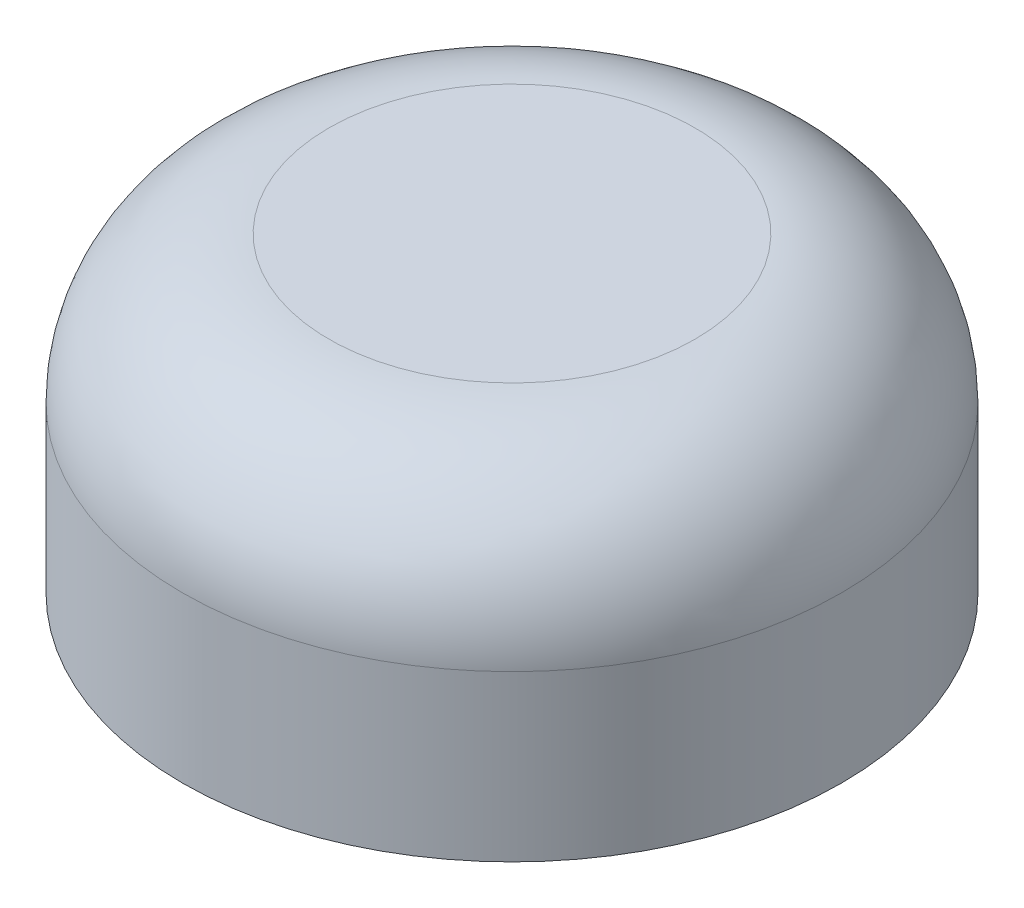
ISO-10303-21;
HEADER;
FILE_DESCRIPTION(('STEP AP214'),'2;1');
FILE_NAME('part.step','',(''),(''),'','','');
FILE_SCHEMA(('AUTOMOTIVE_DESIGN { 1 0 10303 214 1 1 1 1 }'));
ENDSEC;
DATA;
#1=APPLICATION_CONTEXT('core data for automotive mechanical design processes');
#2=APPLICATION_PROTOCOL_DEFINITION('international standard','automotive_design',2000,#1);
#3=PRODUCT_CONTEXT('',#1,'mechanical');
#4=PRODUCT('Part','Part','',(#3));
#5=PRODUCT_RELATED_PRODUCT_CATEGORY('part','',(#4));
#6=PRODUCT_DEFINITION_FORMATION('','',#4);
#7=PRODUCT_DEFINITION_CONTEXT('part definition',#1,'design');
#8=PRODUCT_DEFINITION('design','',#6,#7);
#9=PRODUCT_DEFINITION_SHAPE('','',#8);
#10=(LENGTH_UNIT() NAMED_UNIT(*) SI_UNIT(.MILLI.,.METRE.));
#11=(NAMED_UNIT(*) PLANE_ANGLE_UNIT() SI_UNIT($,.RADIAN.));
#12=(NAMED_UNIT(*) SI_UNIT($,.STERADIAN.) SOLID_ANGLE_UNIT());
#13=UNCERTAINTY_MEASURE_WITH_UNIT(LENGTH_MEASURE(1.E-05),#10,'distance_accuracy_value','');
#14=(GEOMETRIC_REPRESENTATION_CONTEXT(3) GLOBAL_UNCERTAINTY_ASSIGNED_CONTEXT((#13)) GLOBAL_UNIT_ASSIGNED_CONTEXT((#10,
#11,#12)) REPRESENTATION_CONTEXT('',''));
#15=CARTESIAN_POINT('',(0.,0.,0.));
#16=DIRECTION('',(0.,0.,1.));
#17=DIRECTION('',(1.,0.,0.));
#18=AXIS2_PLACEMENT_3D('',#15,#16,#17);
#19=CARTESIAN_POINT('',(0.,0.,0.));
#20=DIRECTION('',(0.,1.,0.));
#21=DIRECTION('',(-1.,0.,0.));
#22=AXIS2_PLACEMENT_3D('',#19,#20,#21);
#23=PLANE('',#22);
#24=CARTESIAN_POINT('',(0.,0.,0.));
#25=DIRECTION('',(0.,1.,0.));
#26=DIRECTION('',(-1.,0.,0.));
#27=AXIS2_PLACEMENT_3D('',#24,#25,#26);
#28=CIRCLE('',#27,1.5);
#29=CARTESIAN_POINT('',(-1.5,0.,0.));
#30=VERTEX_POINT('',#29);
#31=EDGE_CURVE('E10',#30,#30,#28,.T.);
#32=ORIENTED_EDGE('',*,*,#31,.F.);
#33=EDGE_LOOP('',(#32));
#34=FACE_BOUND('',#33,.T.);
#35=ADVANCED_FACE('F32',(#34),#23,.F.);
#36=CARTESIAN_POINT('',(0.,1.75,0.));
#37=DIRECTION('',(0.,1.,0.));
#38=DIRECTION('',(-1.,0.,0.));
#39=AXIS2_PLACEMENT_3D('',#36,#37,#38);
#40=CYLINDRICAL_SURFACE('',#39,1.5);
#41=CARTESIAN_POINT('',(0.,-2.5,0.));
#42=DIRECTION('',(0.,1.,0.));
#43=DIRECTION('',(-1.,0.,0.));
#44=AXIS2_PLACEMENT_3D('',#41,#42,#43);
#45=CIRCLE('',#44,1.5);
#46=CARTESIAN_POINT('',(-1.5,-2.5,0.));
#47=VERTEX_POINT('',#46);
#48=EDGE_CURVE('E38',#47,#47,#45,.T.);
#49=ORIENTED_EDGE('',*,*,#48,.F.);
#50=EDGE_LOOP('',(#49));
#51=FACE_BOUND('',#50,.T.);
#52=ORIENTED_EDGE('',*,*,#31,.T.);
#53=EDGE_LOOP('',(#52));
#54=FACE_BOUND('',#53,.T.);
#55=ADVANCED_FACE('F71',(#51,#54),#40,.F.);
#56=CARTESIAN_POINT('',(1.5,-2.5,0.));
#57=DIRECTION('',(0.,1.,0.));
#58=DIRECTION('',(-1.,0.,0.));
#59=AXIS2_PLACEMENT_3D('',#56,#57,#58);
#60=PLANE('',#59);
#61=CARTESIAN_POINT('',(0.,-2.5,0.));
#62=DIRECTION('',(0.,1.,0.));
#63=DIRECTION('',(-1.,0.,0.));
#64=AXIS2_PLACEMENT_3D('',#61,#62,#63);
#65=CIRCLE('',#64,4.5);
#66=CARTESIAN_POINT('',(-4.5,-2.5,0.));
#67=VERTEX_POINT('',#66);
#68=EDGE_CURVE('E42',#67,#67,#65,.T.);
#69=ORIENTED_EDGE('',*,*,#68,.F.);
#70=EDGE_LOOP('',(#69));
#71=FACE_BOUND('',#70,.T.);
#72=ORIENTED_EDGE('',*,*,#48,.T.);
#73=EDGE_LOOP('',(#72));
#74=FACE_BOUND('',#73,.T.);
#75=ADVANCED_FACE('F66',(#71,#74),#60,.F.);
#76=CARTESIAN_POINT('',(0.,1.75,0.));
#77=DIRECTION('',(0.,1.,0.));
#78=DIRECTION('',(-1.,0.,0.));
#79=AXIS2_PLACEMENT_3D('',#76,#77,#78);
#80=CYLINDRICAL_SURFACE('',#79,4.5);
#81=CARTESIAN_POINT('',(0.,-0.249999999999999,0.));
#82=DIRECTION('',(0.,1.,0.));
#83=DIRECTION('',(-1.,0.,0.));
#84=AXIS2_PLACEMENT_3D('',#81,#82,#83);
#85=CIRCLE('',#84,4.5);
#86=CARTESIAN_POINT('',(-4.5,-0.249999999999999,0.));
#87=VERTEX_POINT('',#86);
#88=EDGE_CURVE('E46',#87,#87,#85,.T.);
#89=ORIENTED_EDGE('',*,*,#88,.F.);
#90=EDGE_LOOP('',(#89));
#91=FACE_BOUND('',#90,.T.);
#92=ORIENTED_EDGE('',*,*,#68,.T.);
#93=EDGE_LOOP('',(#92));
#94=FACE_BOUND('',#93,.T.);
#95=ADVANCED_FACE('F60',(#91,#94),#80,.T.);
#96=CARTESIAN_POINT('',(0.,-0.25,0.));
#97=DIRECTION('',(0.,1.,0.));
#98=DIRECTION('',(-1.,0.,0.));
#99=AXIS2_PLACEMENT_3D('',#96,#97,#98);
#100=TOROIDAL_SURFACE('',#99,2.5,2.);
#101=CARTESIAN_POINT('',(0.,1.75,0.));
#102=DIRECTION('',(0.,1.,0.));
#103=DIRECTION('',(-1.,0.,0.));
#104=AXIS2_PLACEMENT_3D('',#101,#102,#103);
#105=CIRCLE('',#104,2.5);
#106=CARTESIAN_POINT('',(-2.5,1.75,0.));
#107=VERTEX_POINT('',#106);
#108=EDGE_CURVE('E51',#107,#107,#105,.T.);
#109=ORIENTED_EDGE('',*,*,#108,.F.);
#110=EDGE_LOOP('',(#109));
#111=FACE_BOUND('',#110,.T.);
#112=ORIENTED_EDGE('',*,*,#88,.T.);
#113=EDGE_LOOP('',(#112));
#114=FACE_BOUND('',#113,.T.);
#115=ADVANCED_FACE('F57',(#111,#114),#100,.T.);
#116=CARTESIAN_POINT('',(2.5,1.75,0.));
#117=DIRECTION('',(0.,-1.,0.));
#118=DIRECTION('',(1.,0.,0.));
#119=AXIS2_PLACEMENT_3D('',#116,#117,#118);
#120=PLANE('',#119);
#121=ORIENTED_EDGE('',*,*,#108,.T.);
#122=EDGE_LOOP('',(#121));
#123=FACE_BOUND('',#122,.T.);
#124=ADVANCED_FACE('F55',(#123),#120,.F.);
#125=CLOSED_SHELL('',(#35,#55,#75,#95,#115,#124));
#126=MANIFOLD_SOLID_BREP('B2',#125);
#127=ADVANCED_BREP_SHAPE_REPRESENTATION('',(#18,#126),#14);
#128=SHAPE_DEFINITION_REPRESENTATION(#9,#127);
ENDSEC;
END-ISO-10303-21;
